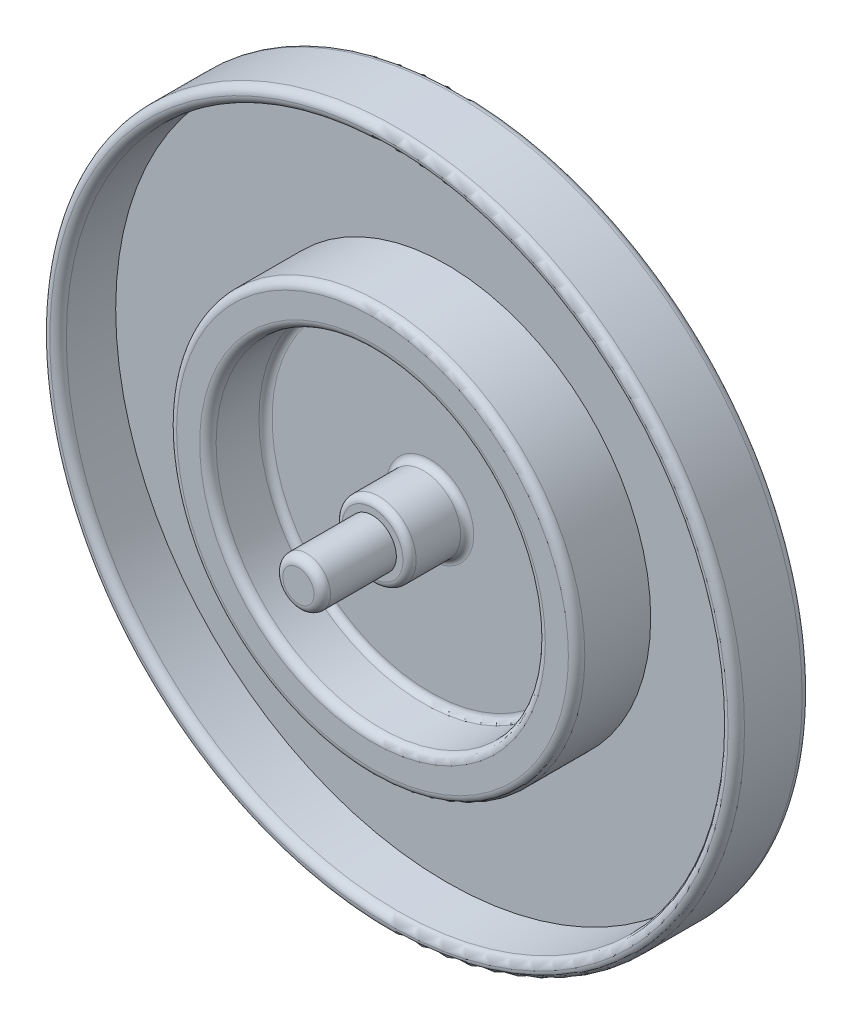
ISO-10303-21;
HEADER;
FILE_DESCRIPTION(('STEP AP214'),'2;1');
FILE_NAME('part.step','',(''),(''),'','','');
FILE_SCHEMA(('AUTOMOTIVE_DESIGN { 1 0 10303 214 1 1 1 1 }'));
ENDSEC;
DATA;
#1=APPLICATION_CONTEXT('core data for automotive mechanical design processes');
#2=APPLICATION_PROTOCOL_DEFINITION('international standard','automotive_design',2000,#1);
#3=PRODUCT_CONTEXT('',#1,'mechanical');
#4=PRODUCT('Part','Part','',(#3));
#5=PRODUCT_RELATED_PRODUCT_CATEGORY('part','',(#4));
#6=PRODUCT_DEFINITION_FORMATION('','',#4);
#7=PRODUCT_DEFINITION_CONTEXT('part definition',#1,'design');
#8=PRODUCT_DEFINITION('design','',#6,#7);
#9=PRODUCT_DEFINITION_SHAPE('','',#8);
#10=(LENGTH_UNIT() NAMED_UNIT(*) SI_UNIT(.MILLI.,.METRE.));
#11=(NAMED_UNIT(*) PLANE_ANGLE_UNIT() SI_UNIT($,.RADIAN.));
#12=(NAMED_UNIT(*) SI_UNIT($,.STERADIAN.) SOLID_ANGLE_UNIT());
#13=UNCERTAINTY_MEASURE_WITH_UNIT(LENGTH_MEASURE(1.E-05),#10,'distance_accuracy_value','');
#14=(GEOMETRIC_REPRESENTATION_CONTEXT(3) GLOBAL_UNCERTAINTY_ASSIGNED_CONTEXT((#13)) GLOBAL_UNIT_ASSIGNED_CONTEXT((#10,
#11,#12)) REPRESENTATION_CONTEXT('',''));
#15=CARTESIAN_POINT('',(0.,0.,0.));
#16=DIRECTION('',(0.,0.,1.));
#17=DIRECTION('',(1.,0.,0.));
#18=AXIS2_PLACEMENT_3D('',#15,#16,#17);
#19=CARTESIAN_POINT('',(0.,0.,4.5));
#20=DIRECTION('',(0.,0.,-1.));
#21=DIRECTION('',(-1.,0.,0.));
#22=AXIS2_PLACEMENT_3D('',#19,#20,#21);
#23=CYLINDRICAL_SURFACE('',#22,10.);
#24=CARTESIAN_POINT('',(0.,0.,1.4));
#25=DIRECTION('',(0.,0.,1.));
#26=DIRECTION('',(1.,0.,0.));
#27=AXIS2_PLACEMENT_3D('',#24,#25,#26);
#28=CIRCLE('',#27,10.);
#29=CARTESIAN_POINT('',(10.,0.,1.4));
#30=VERTEX_POINT('',#29);
#31=EDGE_CURVE('E11',#30,#30,#28,.F.);
#32=ORIENTED_EDGE('',*,*,#31,.T.);
#33=EDGE_LOOP('',(#32));
#34=FACE_BOUND('',#33,.T.);
#35=CARTESIAN_POINT('',(0.,0.,4.));
#36=DIRECTION('',(0.,0.,1.));
#37=DIRECTION('',(1.,0.,0.));
#38=AXIS2_PLACEMENT_3D('',#35,#36,#37);
#39=CIRCLE('',#38,10.);
#40=CARTESIAN_POINT('',(10.,0.,4.));
#41=VERTEX_POINT('',#40);
#42=EDGE_CURVE('E107',#41,#41,#39,.T.);
#43=ORIENTED_EDGE('',*,*,#42,.T.);
#44=EDGE_LOOP('',(#43));
#45=FACE_BOUND('',#44,.T.);
#46=ADVANCED_FACE('F47',(#34,#45),#23,.F.);
#47=CARTESIAN_POINT('',(0.,0.,4.5));
#48=DIRECTION('',(0.,0.,-1.));
#49=DIRECTION('',(-1.,0.,0.));
#50=AXIS2_PLACEMENT_3D('',#47,#48,#49);
#51=CYLINDRICAL_SURFACE('',#50,12.4);
#52=CARTESIAN_POINT('',(0.,0.,4.));
#53=DIRECTION('',(0.,0.,1.));
#54=DIRECTION('',(1.,0.,0.));
#55=AXIS2_PLACEMENT_3D('',#52,#53,#54);
#56=CIRCLE('',#55,12.4);
#57=CARTESIAN_POINT('',(12.4,0.,4.));
#58=VERTEX_POINT('',#57);
#59=EDGE_CURVE('E98',#58,#58,#56,.F.);
#60=ORIENTED_EDGE('',*,*,#59,.T.);
#61=EDGE_LOOP('',(#60));
#62=FACE_BOUND('',#61,.T.);
#63=CARTESIAN_POINT('',(0.,0.,0.));
#64=DIRECTION('',(0.,0.,1.));
#65=DIRECTION('',(1.,0.,0.));
#66=AXIS2_PLACEMENT_3D('',#63,#64,#65);
#67=CIRCLE('',#66,12.4);
#68=CARTESIAN_POINT('',(12.4,0.,0.));
#69=VERTEX_POINT('',#68);
#70=EDGE_CURVE('E110',#69,#69,#67,.T.);
#71=ORIENTED_EDGE('',*,*,#70,.T.);
#72=EDGE_LOOP('',(#71));
#73=FACE_BOUND('',#72,.T.);
#74=ADVANCED_FACE('F135',(#62,#73),#51,.T.);
#75=CARTESIAN_POINT('',(0.,0.,4.5));
#76=DIRECTION('',(0.,0.,1.));
#77=DIRECTION('',(1.,0.,0.));
#78=AXIS2_PLACEMENT_3D('',#75,#76,#77);
#79=PLANE('',#78);
#80=CARTESIAN_POINT('',(0.,0.,4.5));
#81=DIRECTION('',(0.,0.,1.));
#82=DIRECTION('',(1.,0.,0.));
#83=AXIS2_PLACEMENT_3D('',#80,#81,#82);
#84=CIRCLE('',#83,10.5);
#85=CARTESIAN_POINT('',(10.5,0.,4.5));
#86=VERTEX_POINT('',#85);
#87=EDGE_CURVE('E101',#86,#86,#84,.F.);
#88=ORIENTED_EDGE('',*,*,#87,.T.);
#89=EDGE_LOOP('',(#88));
#90=FACE_BOUND('',#89,.T.);
#91=CARTESIAN_POINT('',(0.,0.,4.5));
#92=DIRECTION('',(0.,0.,1.));
#93=DIRECTION('',(1.,0.,0.));
#94=AXIS2_PLACEMENT_3D('',#91,#92,#93);
#95=CIRCLE('',#94,11.9);
#96=CARTESIAN_POINT('',(11.9,0.,4.5));
#97=VERTEX_POINT('',#96);
#98=EDGE_CURVE('E104',#97,#97,#95,.T.);
#99=ORIENTED_EDGE('',*,*,#98,.T.);
#100=EDGE_LOOP('',(#99));
#101=FACE_BOUND('',#100,.T.);
#102=ADVANCED_FACE('F131',(#90,#101),#79,.T.);
#103=CARTESIAN_POINT('',(0.,0.,0.));
#104=DIRECTION('',(0.,0.,-1.));
#105=DIRECTION('',(-1.,0.,0.));
#106=AXIS2_PLACEMENT_3D('',#103,#104,#105);
#107=PLANE('',#106);
#108=CARTESIAN_POINT('',(0.,0.,0.));
#109=DIRECTION('',(0.,0.,1.));
#110=DIRECTION('',(1.,0.,0.));
#111=AXIS2_PLACEMENT_3D('',#108,#109,#110);
#112=CIRCLE('',#111,20.1);
#113=CARTESIAN_POINT('',(20.1,0.,0.));
#114=VERTEX_POINT('',#113);
#115=EDGE_CURVE('E80',#114,#114,#112,.T.);
#116=ORIENTED_EDGE('',*,*,#115,.T.);
#117=EDGE_LOOP('',(#116));
#118=FACE_BOUND('',#117,.T.);
#119=ORIENTED_EDGE('',*,*,#70,.F.);
#120=EDGE_LOOP('',(#119));
#121=FACE_BOUND('',#120,.T.);
#122=ADVANCED_FACE('F116',(#118,#121),#107,.F.);
#123=CARTESIAN_POINT('',(0.,0.,4.5));
#124=DIRECTION('',(0.,0.,-1.));
#125=DIRECTION('',(-1.,0.,0.));
#126=AXIS2_PLACEMENT_3D('',#123,#124,#125);
#127=CYLINDRICAL_SURFACE('',#126,20.1);
#128=CARTESIAN_POINT('',(0.,0.,3.));
#129=DIRECTION('',(0.,0.,1.));
#130=DIRECTION('',(1.,0.,0.));
#131=AXIS2_PLACEMENT_3D('',#128,#129,#130);
#132=CIRCLE('',#131,20.1);
#133=CARTESIAN_POINT('',(20.1,0.,3.));
#134=VERTEX_POINT('',#133);
#135=EDGE_CURVE('E95',#134,#134,#132,.T.);
#136=ORIENTED_EDGE('',*,*,#135,.T.);
#137=EDGE_LOOP('',(#136));
#138=FACE_BOUND('',#137,.T.);
#139=ORIENTED_EDGE('',*,*,#115,.F.);
#140=EDGE_LOOP('',(#139));
#141=FACE_BOUND('',#140,.T.);
#142=ADVANCED_FACE('F119',(#138,#141),#127,.F.);
#143=CARTESIAN_POINT('',(0.,0.,-1.));
#144=DIRECTION('',(0.,0.,-1.));
#145=DIRECTION('',(-1.,0.,0.));
#146=AXIS2_PLACEMENT_3D('',#143,#144,#145);
#147=PLANE('',#146);
#148=CARTESIAN_POINT('',(0.,0.,-1.));
#149=DIRECTION('',(0.,0.,-1.));
#150=DIRECTION('',(-1.,0.,0.));
#151=AXIS2_PLACEMENT_3D('',#148,#149,#150);
#152=CIRCLE('',#151,20.6);
#153=CARTESIAN_POINT('',(-20.6,0.,-1.));
#154=VERTEX_POINT('',#153);
#155=EDGE_CURVE('E73',#154,#154,#152,.T.);
#156=ORIENTED_EDGE('',*,*,#155,.T.);
#157=EDGE_LOOP('',(#156));
#158=FACE_BOUND('',#157,.T.);
#159=ADVANCED_FACE('F121',(#158),#147,.T.);
#160=CARTESIAN_POINT('',(0.,0.,-1.));
#161=DIRECTION('',(0.,0.,1.));
#162=DIRECTION('',(1.,0.,0.));
#163=AXIS2_PLACEMENT_3D('',#160,#161,#162);
#164=CYLINDRICAL_SURFACE('',#163,21.1);
#165=CARTESIAN_POINT('',(0.,0.,3.));
#166=DIRECTION('',(0.,0.,1.));
#167=DIRECTION('',(1.,0.,0.));
#168=AXIS2_PLACEMENT_3D('',#165,#166,#167);
#169=CIRCLE('',#168,21.1);
#170=CARTESIAN_POINT('',(21.1,0.,3.));
#171=VERTEX_POINT('',#170);
#172=EDGE_CURVE('E89',#171,#171,#169,.F.);
#173=ORIENTED_EDGE('',*,*,#172,.T.);
#174=EDGE_LOOP('',(#173));
#175=FACE_BOUND('',#174,.T.);
#176=CARTESIAN_POINT('',(0.,0.,-0.5));
#177=DIRECTION('',(0.,0.,-1.));
#178=DIRECTION('',(-1.,0.,0.));
#179=AXIS2_PLACEMENT_3D('',#176,#177,#178);
#180=CIRCLE('',#179,21.1);
#181=CARTESIAN_POINT('',(-21.1,0.,-0.5));
#182=VERTEX_POINT('',#181);
#183=EDGE_CURVE('E92',#182,#182,#180,.F.);
#184=ORIENTED_EDGE('',*,*,#183,.T.);
#185=EDGE_LOOP('',(#184));
#186=FACE_BOUND('',#185,.T.);
#187=ADVANCED_FACE('F128',(#175,#186),#164,.T.);
#188=CARTESIAN_POINT('',(0.,0.,4.));
#189=DIRECTION('',(0.,0.,1.));
#190=DIRECTION('',(1.,0.,0.));
#191=AXIS2_PLACEMENT_3D('',#188,#189,#190);
#192=TOROIDAL_SURFACE('',#191,10.5,0.5);
#193=ORIENTED_EDGE('',*,*,#87,.F.);
#194=EDGE_LOOP('',(#193));
#195=FACE_BOUND('',#194,.T.);
#196=ORIENTED_EDGE('',*,*,#42,.F.);
#197=EDGE_LOOP('',(#196));
#198=FACE_BOUND('',#197,.T.);
#199=ADVANCED_FACE('F145',(#195,#198),#192,.T.);
#200=CARTESIAN_POINT('',(0.,0.,4.));
#201=DIRECTION('',(0.,0.,1.));
#202=DIRECTION('',(1.,0.,0.));
#203=AXIS2_PLACEMENT_3D('',#200,#201,#202);
#204=TOROIDAL_SURFACE('',#203,11.9,0.5);
#205=ORIENTED_EDGE('',*,*,#59,.F.);
#206=EDGE_LOOP('',(#205));
#207=FACE_BOUND('',#206,.T.);
#208=ORIENTED_EDGE('',*,*,#98,.F.);
#209=EDGE_LOOP('',(#208));
#210=FACE_BOUND('',#209,.T.);
#211=ADVANCED_FACE('F148',(#207,#210),#204,.T.);
#212=CARTESIAN_POINT('',(0.,0.,3.));
#213=DIRECTION('',(0.,0.,1.));
#214=DIRECTION('',(1.,0.,0.));
#215=AXIS2_PLACEMENT_3D('',#212,#213,#214);
#216=TOROIDAL_SURFACE('',#215,20.6,0.5);
#217=ORIENTED_EDGE('',*,*,#172,.F.);
#218=EDGE_LOOP('',(#217));
#219=FACE_BOUND('',#218,.T.);
#220=CARTESIAN_POINT('',(0.,0.,3.5));
#221=DIRECTION('',(0.,0.,1.));
#222=DIRECTION('',(1.,0.,0.));
#223=AXIS2_PLACEMENT_3D('',#220,#221,#222);
#224=CIRCLE('',#223,20.6);
#225=CARTESIAN_POINT('',(20.6,0.,3.5));
#226=VERTEX_POINT('',#225);
#227=EDGE_CURVE('E77',#226,#226,#224,.T.);
#228=ORIENTED_EDGE('',*,*,#227,.F.);
#229=EDGE_LOOP('',(#228));
#230=FACE_BOUND('',#229,.T.);
#231=ADVANCED_FACE('F152',(#219,#230),#216,.T.);
#232=CARTESIAN_POINT('',(0.,0.,3.));
#233=DIRECTION('',(0.,0.,1.));
#234=DIRECTION('',(1.,0.,0.));
#235=AXIS2_PLACEMENT_3D('',#232,#233,#234);
#236=TOROIDAL_SURFACE('',#235,20.6,0.5);
#237=ORIENTED_EDGE('',*,*,#227,.T.);
#238=EDGE_LOOP('',(#237));
#239=FACE_BOUND('',#238,.T.);
#240=ORIENTED_EDGE('',*,*,#135,.F.);
#241=EDGE_LOOP('',(#240));
#242=FACE_BOUND('',#241,.T.);
#243=ADVANCED_FACE('F154',(#239,#242),#236,.T.);
#244=CARTESIAN_POINT('',(0.,0.,-0.5));
#245=DIRECTION('',(0.,0.,-1.));
#246=DIRECTION('',(-1.,0.,0.));
#247=AXIS2_PLACEMENT_3D('',#244,#245,#246);
#248=TOROIDAL_SURFACE('',#247,20.6,0.5);
#249=ORIENTED_EDGE('',*,*,#183,.F.);
#250=EDGE_LOOP('',(#249));
#251=FACE_BOUND('',#250,.T.);
#252=ORIENTED_EDGE('',*,*,#155,.F.);
#253=EDGE_LOOP('',(#252));
#254=FACE_BOUND('',#253,.T.);
#255=ADVANCED_FACE('F157',(#251,#254),#248,.T.);
#256=CARTESIAN_POINT('',(0.,0.,1.));
#257=DIRECTION('',(0.,0.,1.));
#258=DIRECTION('',(1.,0.,0.));
#259=AXIS2_PLACEMENT_3D('',#256,#257,#258);
#260=PLANE('',#259);
#261=CARTESIAN_POINT('',(0.,0.,1.));
#262=DIRECTION('',(0.,0.,1.));
#263=DIRECTION('',(1.,0.,0.));
#264=AXIS2_PLACEMENT_3D('',#261,#262,#263);
#265=CIRCLE('',#264,2.65);
#266=CARTESIAN_POINT('',(2.65,0.,1.));
#267=VERTEX_POINT('',#266);
#268=EDGE_CURVE('E54',#267,#267,#265,.F.);
#269=ORIENTED_EDGE('',*,*,#268,.T.);
#270=EDGE_LOOP('',(#269));
#271=FACE_BOUND('',#270,.T.);
#272=CARTESIAN_POINT('',(0.,0.,1.));
#273=DIRECTION('',(0.,0.,1.));
#274=DIRECTION('',(1.,0.,0.));
#275=AXIS2_PLACEMENT_3D('',#272,#273,#274);
#276=CIRCLE('',#275,9.6);
#277=CARTESIAN_POINT('',(9.6,0.,1.));
#278=VERTEX_POINT('',#277);
#279=EDGE_CURVE('E58',#278,#278,#276,.T.);
#280=ORIENTED_EDGE('',*,*,#279,.T.);
#281=EDGE_LOOP('',(#280));
#282=FACE_BOUND('',#281,.T.);
#283=ADVANCED_FACE('F170',(#271,#282),#260,.T.);
#284=CARTESIAN_POINT('',(0.,0.,4.5));
#285=DIRECTION('',(0.,0.,-1.));
#286=DIRECTION('',(-1.,0.,0.));
#287=AXIS2_PLACEMENT_3D('',#284,#285,#286);
#288=CYLINDRICAL_SURFACE('',#287,2.25);
#289=CARTESIAN_POINT('',(0.,0.,4.1));
#290=DIRECTION('',(0.,0.,1.));
#291=DIRECTION('',(1.,0.,0.));
#292=AXIS2_PLACEMENT_3D('',#289,#290,#291);
#293=CIRCLE('',#292,2.25);
#294=CARTESIAN_POINT('',(2.25,0.,4.1));
#295=VERTEX_POINT('',#294);
#296=EDGE_CURVE('E62',#295,#295,#293,.F.);
#297=ORIENTED_EDGE('',*,*,#296,.T.);
#298=EDGE_LOOP('',(#297));
#299=FACE_BOUND('',#298,.T.);
#300=CARTESIAN_POINT('',(0.,0.,1.4));
#301=DIRECTION('',(0.,0.,1.));
#302=DIRECTION('',(1.,0.,0.));
#303=AXIS2_PLACEMENT_3D('',#300,#301,#302);
#304=CIRCLE('',#303,2.25);
#305=CARTESIAN_POINT('',(2.25,0.,1.4));
#306=VERTEX_POINT('',#305);
#307=EDGE_CURVE('E67',#306,#306,#304,.T.);
#308=ORIENTED_EDGE('',*,*,#307,.T.);
#309=EDGE_LOOP('',(#308));
#310=FACE_BOUND('',#309,.T.);
#311=ADVANCED_FACE('F185',(#299,#310),#288,.T.);
#312=CARTESIAN_POINT('',(0.,0.,4.5));
#313=DIRECTION('',(0.,0.,1.));
#314=DIRECTION('',(1.,0.,0.));
#315=AXIS2_PLACEMENT_3D('',#312,#313,#314);
#316=PLANE('',#315);
#317=CARTESIAN_POINT('',(0.,0.,4.5));
#318=DIRECTION('',(0.,0.,1.));
#319=DIRECTION('',(1.,0.,0.));
#320=AXIS2_PLACEMENT_3D('',#317,#318,#319);
#321=CIRCLE('',#320,1.85);
#322=CARTESIAN_POINT('',(1.85,0.,4.5));
#323=VERTEX_POINT('',#322);
#324=EDGE_CURVE('E70',#323,#323,#321,.T.);
#325=ORIENTED_EDGE('',*,*,#324,.T.);
#326=EDGE_LOOP('',(#325));
#327=FACE_BOUND('',#326,.T.);
#328=CARTESIAN_POINT('',(0.,0.,4.5));
#329=DIRECTION('',(0.,0.,1.));
#330=DIRECTION('',(1.,0.,0.));
#331=AXIS2_PLACEMENT_3D('',#328,#329,#330);
#332=CIRCLE('',#331,1.45);
#333=CARTESIAN_POINT('',(1.45,0.,4.5));
#334=VERTEX_POINT('',#333);
#335=EDGE_CURVE('E74',#334,#334,#332,.T.);
#336=ORIENTED_EDGE('',*,*,#335,.F.);
#337=EDGE_LOOP('',(#336));
#338=FACE_BOUND('',#337,.T.);
#339=ADVANCED_FACE('F187',(#327,#338),#316,.T.);
#340=CARTESIAN_POINT('',(0.,0.,9.));
#341=DIRECTION('',(0.,0.,1.));
#342=DIRECTION('',(1.,0.,0.));
#343=AXIS2_PLACEMENT_3D('',#340,#341,#342);
#344=PLANE('',#343);
#345=CARTESIAN_POINT('',(0.,0.,9.));
#346=DIRECTION('',(0.,0.,1.));
#347=DIRECTION('',(1.,0.,0.));
#348=AXIS2_PLACEMENT_3D('',#345,#346,#347);
#349=CIRCLE('',#348,0.95);
#350=CARTESIAN_POINT('',(0.95,0.,9.));
#351=VERTEX_POINT('',#350);
#352=EDGE_CURVE('E86',#351,#351,#349,.T.);
#353=ORIENTED_EDGE('',*,*,#352,.T.);
#354=EDGE_LOOP('',(#353));
#355=FACE_BOUND('',#354,.T.);
#356=ADVANCED_FACE('F166',(#355),#344,.T.);
#357=CARTESIAN_POINT('',(0.,0.,8.5));
#358=DIRECTION('',(0.,0.,1.));
#359=DIRECTION('',(1.,0.,0.));
#360=AXIS2_PLACEMENT_3D('',#357,#358,#359);
#361=TOROIDAL_SURFACE('',#360,0.95,0.5);
#362=CARTESIAN_POINT('',(0.,0.,8.5));
#363=DIRECTION('',(0.,0.,1.));
#364=DIRECTION('',(1.,0.,0.));
#365=AXIS2_PLACEMENT_3D('',#362,#363,#364);
#366=CIRCLE('',#365,1.45);
#367=CARTESIAN_POINT('',(1.45,0.,8.5));
#368=VERTEX_POINT('',#367);
#369=EDGE_CURVE('E83',#368,#368,#366,.F.);
#370=ORIENTED_EDGE('',*,*,#369,.F.);
#371=EDGE_LOOP('',(#370));
#372=FACE_BOUND('',#371,.T.);
#373=ORIENTED_EDGE('',*,*,#352,.F.);
#374=EDGE_LOOP('',(#373));
#375=FACE_BOUND('',#374,.T.);
#376=ADVANCED_FACE('F162',(#372,#375),#361,.T.);
#377=CARTESIAN_POINT('',(0.,0.,9.));
#378=DIRECTION('',(0.,0.,-1.));
#379=DIRECTION('',(-1.,0.,0.));
#380=AXIS2_PLACEMENT_3D('',#377,#378,#379);
#381=CYLINDRICAL_SURFACE('',#380,1.45);
#382=ORIENTED_EDGE('',*,*,#335,.T.);
#383=EDGE_LOOP('',(#382));
#384=FACE_BOUND('',#383,.T.);
#385=ORIENTED_EDGE('',*,*,#369,.T.);
#386=EDGE_LOOP('',(#385));
#387=FACE_BOUND('',#386,.T.);
#388=ADVANCED_FACE('F165',(#384,#387),#381,.T.);
#389=CARTESIAN_POINT('',(0.,0.,4.1));
#390=DIRECTION('',(0.,0.,1.));
#391=DIRECTION('',(1.,0.,0.));
#392=AXIS2_PLACEMENT_3D('',#389,#390,#391);
#393=TOROIDAL_SURFACE('',#392,1.85,0.4);
#394=ORIENTED_EDGE('',*,*,#296,.F.);
#395=EDGE_LOOP('',(#394));
#396=FACE_BOUND('',#395,.T.);
#397=ORIENTED_EDGE('',*,*,#324,.F.);
#398=EDGE_LOOP('',(#397));
#399=FACE_BOUND('',#398,.T.);
#400=ADVANCED_FACE('F172',(#396,#399),#393,.T.);
#401=CARTESIAN_POINT('',(0.,0.,1.4));
#402=DIRECTION('',(0.,0.,1.));
#403=DIRECTION('',(1.,0.,0.));
#404=AXIS2_PLACEMENT_3D('',#401,#402,#403);
#405=TOROIDAL_SURFACE('',#404,2.65,0.4);
#406=ORIENTED_EDGE('',*,*,#268,.F.);
#407=EDGE_LOOP('',(#406));
#408=FACE_BOUND('',#407,.T.);
#409=ORIENTED_EDGE('',*,*,#307,.F.);
#410=EDGE_LOOP('',(#409));
#411=FACE_BOUND('',#410,.T.);
#412=ADVANCED_FACE('F174',(#408,#411),#405,.F.);
#413=CARTESIAN_POINT('',(0.,0.,1.4));
#414=DIRECTION('',(0.,0.,1.));
#415=DIRECTION('',(1.,0.,0.));
#416=AXIS2_PLACEMENT_3D('',#413,#414,#415);
#417=TOROIDAL_SURFACE('',#416,9.6,0.4);
#418=ORIENTED_EDGE('',*,*,#31,.F.);
#419=EDGE_LOOP('',(#418));
#420=FACE_BOUND('',#419,.T.);
#421=ORIENTED_EDGE('',*,*,#279,.F.);
#422=EDGE_LOOP('',(#421));
#423=FACE_BOUND('',#422,.T.);
#424=ADVANCED_FACE('F49',(#420,#423),#417,.F.);
#425=CLOSED_SHELL('',(#46,#74,#102,#122,#142,#159,#187,#199,#211,#231,#243,#255,#283,#311,#339,
#356,#376,#388,#400,#412,#424));
#426=MANIFOLD_SOLID_BREP('B2',#425);
#427=ADVANCED_BREP_SHAPE_REPRESENTATION('',(#18,#426),#14);
#428=SHAPE_DEFINITION_REPRESENTATION(#9,#427);
ENDSEC;
END-ISO-10303-21;
